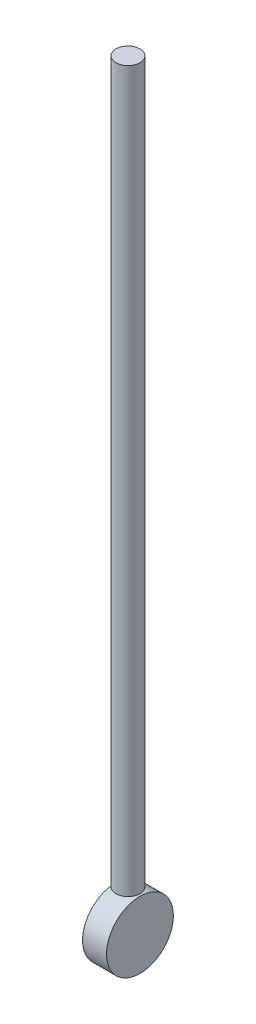
ISO-10303-21;
HEADER;
FILE_DESCRIPTION(('STEP AP214'),'2;1');
FILE_NAME('part.step','',(''),(''),'','','');
FILE_SCHEMA(('AUTOMOTIVE_DESIGN { 1 0 10303 214 1 1 1 1 }'));
ENDSEC;
DATA;
#1=APPLICATION_CONTEXT('core data for automotive mechanical design processes');
#2=APPLICATION_PROTOCOL_DEFINITION('international standard','automotive_design',2000,#1);
#3=PRODUCT_CONTEXT('',#1,'mechanical');
#4=PRODUCT('Part','Part','',(#3));
#5=PRODUCT_RELATED_PRODUCT_CATEGORY('part','',(#4));
#6=PRODUCT_DEFINITION_FORMATION('','',#4);
#7=PRODUCT_DEFINITION_CONTEXT('part definition',#1,'design');
#8=PRODUCT_DEFINITION('design','',#6,#7);
#9=PRODUCT_DEFINITION_SHAPE('','',#8);
#10=(LENGTH_UNIT() NAMED_UNIT(*) SI_UNIT(.MILLI.,.METRE.));
#11=(NAMED_UNIT(*) PLANE_ANGLE_UNIT() SI_UNIT($,.RADIAN.));
#12=(NAMED_UNIT(*) SI_UNIT($,.STERADIAN.) SOLID_ANGLE_UNIT());
#13=UNCERTAINTY_MEASURE_WITH_UNIT(LENGTH_MEASURE(1.E-05),#10,'distance_accuracy_value','');
#14=(GEOMETRIC_REPRESENTATION_CONTEXT(3) GLOBAL_UNCERTAINTY_ASSIGNED_CONTEXT((#13)) GLOBAL_UNIT_ASSIGNED_CONTEXT((#10,
#11,#12)) REPRESENTATION_CONTEXT('',''));
#15=CARTESIAN_POINT('',(0.,0.,0.));
#16=DIRECTION('',(0.,0.,1.));
#17=DIRECTION('',(1.,0.,0.));
#18=AXIS2_PLACEMENT_3D('',#15,#16,#17);
#19=CARTESIAN_POINT('',(6.35,-18.8638386143936,0.));
#20=DIRECTION('',(-1.,0.,0.));
#21=DIRECTION('',(0.,0.,1.));
#22=AXIS2_PLACEMENT_3D('',#19,#20,#21);
#23=CYLINDRICAL_SURFACE('',#22,17.7005921938415);
#24=CARTESIAN_POINT('',(6.35,-18.8638386143936,0.));
#25=DIRECTION('',(1.,0.,0.));
#26=DIRECTION('',(0.,0.,-1.));
#27=AXIS2_PLACEMENT_3D('',#24,#25,#26);
#28=CIRCLE('',#27,17.7005921938415);
#29=CARTESIAN_POINT('',(6.35,-18.8638386143936,-17.7005921938415));
#30=VERTEX_POINT('',#29);
#31=EDGE_CURVE('E11',#30,#30,#28,.T.);
#32=ORIENTED_EDGE('',*,*,#31,.F.);
#33=EDGE_LOOP('',(#32));
#34=FACE_BOUND('',#33,.T.);
#35=CARTESIAN_POINT('',(-6.35,-18.8638386143936,0.));
#36=DIRECTION('',(1.,0.,0.));
#37=DIRECTION('',(0.,0.,-1.));
#38=AXIS2_PLACEMENT_3D('',#35,#36,#37);
#39=CIRCLE('',#38,17.7005921938415);
#40=CARTESIAN_POINT('',(-6.35,-18.8638386143936,-17.7005921938415));
#41=VERTEX_POINT('',#40);
#42=EDGE_CURVE('E48',#41,#41,#39,.T.);
#43=ORIENTED_EDGE('',*,*,#42,.T.);
#44=EDGE_LOOP('',(#43));
#45=FACE_BOUND('',#44,.T.);
#46=ADVANCED_FACE('F45',(#34,#45),#23,.T.);
#47=CARTESIAN_POINT('',(6.35,-18.8638386143936,0.));
#48=DIRECTION('',(1.,0.,0.));
#49=DIRECTION('',(0.,0.,-1.));
#50=AXIS2_PLACEMENT_3D('',#47,#48,#49);
#51=PLANE('',#50);
#52=ORIENTED_EDGE('',*,*,#31,.T.);
#53=EDGE_LOOP('',(#52));
#54=FACE_BOUND('',#53,.T.);
#55=ADVANCED_FACE('F60',(#54),#51,.T.);
#56=CARTESIAN_POINT('',(-6.35,-18.8638386143936,0.));
#57=DIRECTION('',(1.,0.,0.));
#58=DIRECTION('',(0.,0.,-1.));
#59=AXIS2_PLACEMENT_3D('',#56,#57,#58);
#60=PLANE('',#59);
#61=ORIENTED_EDGE('',*,*,#42,.F.);
#62=EDGE_LOOP('',(#61));
#63=FACE_BOUND('',#62,.T.);
#64=ADVANCED_FACE('F58',(#63),#60,.F.);
#65=CLOSED_SHELL('',(#46,#55,#64));
#66=MANIFOLD_SOLID_BREP('B2',#65);
#67=CARTESIAN_POINT('',(0.,381.,0.));
#68=DIRECTION('',(0.,-1.,0.));
#69=DIRECTION('',(0.,0.,-1.));
#70=AXIS2_PLACEMENT_3D('',#67,#68,#69);
#71=CYLINDRICAL_SURFACE('',#70,6.35);
#72=CARTESIAN_POINT('',(0.,381.,0.));
#73=DIRECTION('',(0.,1.,0.));
#74=DIRECTION('',(0.,0.,1.));
#75=AXIS2_PLACEMENT_3D('',#72,#73,#74);
#76=CIRCLE('',#75,6.35);
#77=CARTESIAN_POINT('',(0.,381.,6.35));
#78=VERTEX_POINT('',#77);
#79=EDGE_CURVE('E44',#78,#78,#76,.T.);
#80=ORIENTED_EDGE('',*,*,#79,.F.);
#81=EDGE_LOOP('',(#80));
#82=FACE_BOUND('',#81,.T.);
#83=CARTESIAN_POINT('',(0.,0.,0.));
#84=DIRECTION('',(0.,1.,0.));
#85=DIRECTION('',(0.,0.,1.));
#86=AXIS2_PLACEMENT_3D('',#83,#84,#85);
#87=CIRCLE('',#86,6.35);
#88=CARTESIAN_POINT('',(0.,0.,6.35));
#89=VERTEX_POINT('',#88);
#90=EDGE_CURVE('E89',#89,#89,#87,.T.);
#91=ORIENTED_EDGE('',*,*,#90,.T.);
#92=EDGE_LOOP('',(#91));
#93=FACE_BOUND('',#92,.T.);
#94=ADVANCED_FACE('F86',(#82,#93),#71,.T.);
#95=CARTESIAN_POINT('',(0.,381.,0.));
#96=DIRECTION('',(0.,1.,0.));
#97=DIRECTION('',(0.,0.,1.));
#98=AXIS2_PLACEMENT_3D('',#95,#96,#97);
#99=PLANE('',#98);
#100=ORIENTED_EDGE('',*,*,#79,.T.);
#101=EDGE_LOOP('',(#100));
#102=FACE_BOUND('',#101,.T.);
#103=ADVANCED_FACE('F103',(#102),#99,.T.);
#104=CARTESIAN_POINT('',(0.,0.,0.));
#105=DIRECTION('',(0.,1.,0.));
#106=DIRECTION('',(0.,0.,1.));
#107=AXIS2_PLACEMENT_3D('',#104,#105,#106);
#108=PLANE('',#107);
#109=ORIENTED_EDGE('',*,*,#90,.F.);
#110=EDGE_LOOP('',(#109));
#111=FACE_BOUND('',#110,.T.);
#112=ADVANCED_FACE('F101',(#111),#108,.F.);
#113=CLOSED_SHELL('',(#94,#103,#112));
#114=MANIFOLD_SOLID_BREP('B6',#113);
#115=ADVANCED_BREP_SHAPE_REPRESENTATION('',(#18,#66,#114),#14);
#116=SHAPE_DEFINITION_REPRESENTATION(#9,#115);
ENDSEC;
END-ISO-10303-21;
